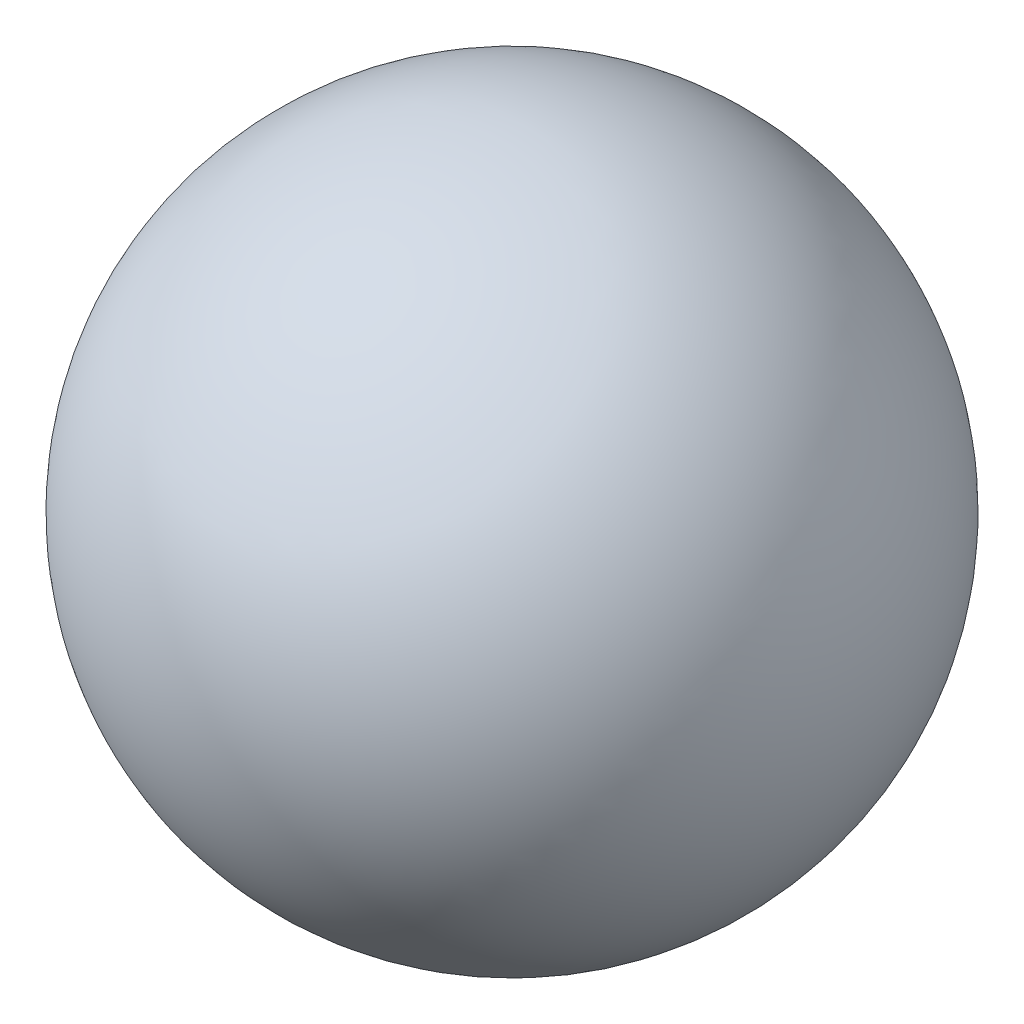
ISO-10303-21;
HEADER;
FILE_DESCRIPTION(('STEP AP214'),'2;1');
FILE_NAME('part.step','',(''),(''),'','','');
FILE_SCHEMA(('AUTOMOTIVE_DESIGN { 1 0 10303 214 1 1 1 1 }'));
ENDSEC;
DATA;
#1=APPLICATION_CONTEXT('core data for automotive mechanical design processes');
#2=APPLICATION_PROTOCOL_DEFINITION('international standard','automotive_design',2000,#1);
#3=PRODUCT_CONTEXT('',#1,'mechanical');
#4=PRODUCT('Part','Part','',(#3));
#5=PRODUCT_RELATED_PRODUCT_CATEGORY('part','',(#4));
#6=PRODUCT_DEFINITION_FORMATION('','',#4);
#7=PRODUCT_DEFINITION_CONTEXT('part definition',#1,'design');
#8=PRODUCT_DEFINITION('design','',#6,#7);
#9=PRODUCT_DEFINITION_SHAPE('','',#8);
#10=(LENGTH_UNIT() NAMED_UNIT(*) SI_UNIT(.MILLI.,.METRE.));
#11=(NAMED_UNIT(*) PLANE_ANGLE_UNIT() SI_UNIT($,.RADIAN.));
#12=(NAMED_UNIT(*) SI_UNIT($,.STERADIAN.) SOLID_ANGLE_UNIT());
#13=UNCERTAINTY_MEASURE_WITH_UNIT(LENGTH_MEASURE(1.E-05),#10,'distance_accuracy_value','');
#14=(GEOMETRIC_REPRESENTATION_CONTEXT(3) GLOBAL_UNCERTAINTY_ASSIGNED_CONTEXT((#13)) GLOBAL_UNIT_ASSIGNED_CONTEXT((#10,
#11,#12)) REPRESENTATION_CONTEXT('',''));
#15=CARTESIAN_POINT('',(0.,0.,0.));
#16=DIRECTION('',(0.,0.,1.));
#17=DIRECTION('',(1.,0.,0.));
#18=AXIS2_PLACEMENT_3D('',#15,#16,#17);
#19=CARTESIAN_POINT('',(11.4187859278016,-2.,2.77016749223579));
#20=DIRECTION('',(0.,0.,1.));
#21=DIRECTION('',(1.,0.,0.));
#22=AXIS2_PLACEMENT_3D('',#19,#20,#21);
#23=SPHERICAL_SURFACE('',#22,1.05);
#24=CARTESIAN_POINT('',(11.4187859278016,-2.,3.82016749223579));
#25=VERTEX_POINT('',#24);
#26=VERTEX_LOOP('',#25);
#27=FACE_BOUND('',#26,.T.);
#28=ADVANCED_FACE('F12',(#27),#23,.T.);
#29=CLOSED_SHELL('',(#28));
#30=MANIFOLD_SOLID_BREP('B1',#29);
#31=ADVANCED_BREP_SHAPE_REPRESENTATION('',(#18,#30),#14);
#32=SHAPE_DEFINITION_REPRESENTATION(#9,#31);
ENDSEC;
END-ISO-10303-21;
